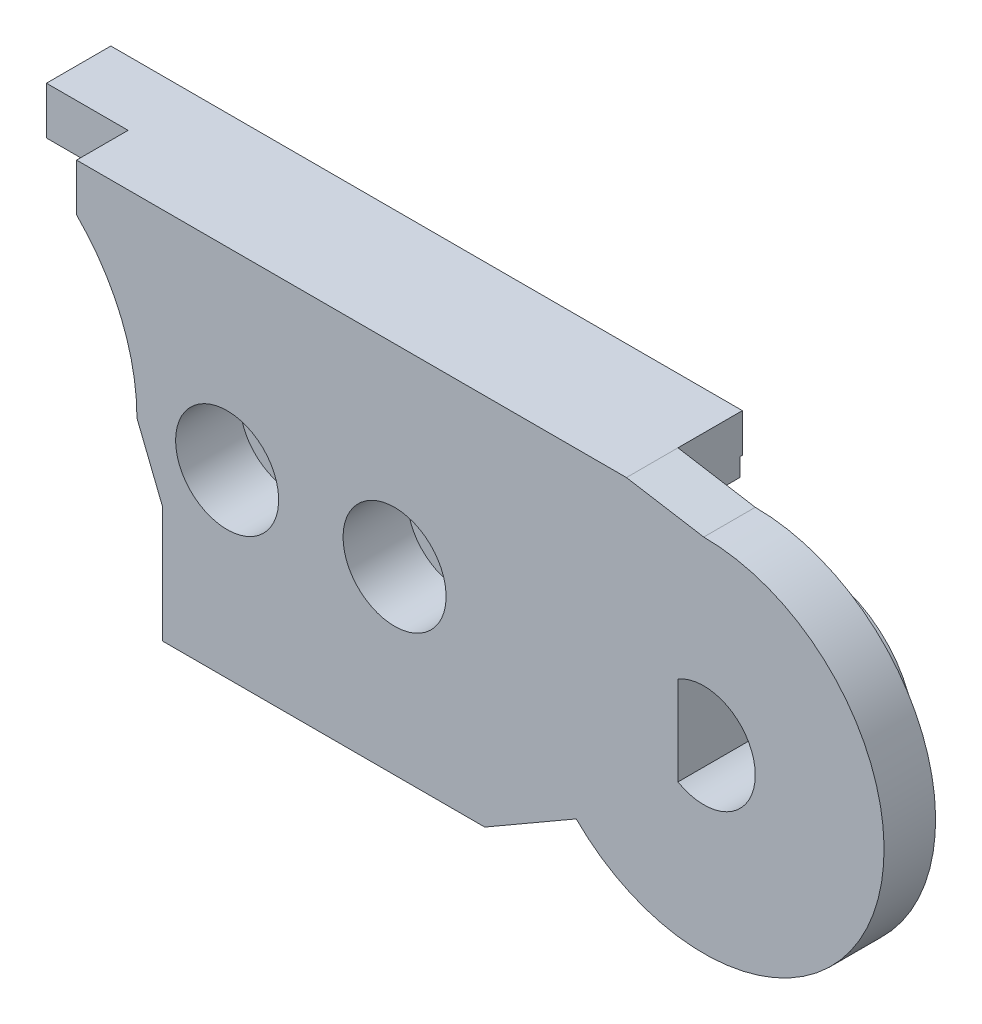
ISO-10303-21;
HEADER;
FILE_DESCRIPTION(('STEP AP214'),'2;1');
FILE_NAME('part.step','',(''),(''),'','','');
FILE_SCHEMA(('AUTOMOTIVE_DESIGN { 1 0 10303 214 1 1 1 1 }'));
ENDSEC;
DATA;
#1=APPLICATION_CONTEXT('core data for automotive mechanical design processes');
#2=APPLICATION_PROTOCOL_DEFINITION('international standard','automotive_design',2000,#1);
#3=PRODUCT_CONTEXT('',#1,'mechanical');
#4=PRODUCT('Part','Part','',(#3));
#5=PRODUCT_RELATED_PRODUCT_CATEGORY('part','',(#4));
#6=PRODUCT_DEFINITION_FORMATION('','',#4);
#7=PRODUCT_DEFINITION_CONTEXT('part definition',#1,'design');
#8=PRODUCT_DEFINITION('design','',#6,#7);
#9=PRODUCT_DEFINITION_SHAPE('','',#8);
#10=(LENGTH_UNIT() NAMED_UNIT(*) SI_UNIT(.MILLI.,.METRE.));
#11=(NAMED_UNIT(*) PLANE_ANGLE_UNIT() SI_UNIT($,.RADIAN.));
#12=(NAMED_UNIT(*) SI_UNIT($,.STERADIAN.) SOLID_ANGLE_UNIT());
#13=UNCERTAINTY_MEASURE_WITH_UNIT(LENGTH_MEASURE(1.E-05),#10,'distance_accuracy_value','');
#14=(GEOMETRIC_REPRESENTATION_CONTEXT(3) GLOBAL_UNCERTAINTY_ASSIGNED_CONTEXT((#13)) GLOBAL_UNIT_ASSIGNED_CONTEXT((#10,
#11,#12)) REPRESENTATION_CONTEXT('',''));
#15=CARTESIAN_POINT('',(0.,0.,0.));
#16=DIRECTION('',(0.,0.,1.));
#17=DIRECTION('',(1.,0.,0.));
#18=AXIS2_PLACEMENT_3D('',#15,#16,#17);
#19=CARTESIAN_POINT('',(18.,0.,16.));
#20=DIRECTION('',(0.,0.,-1.));
#21=DIRECTION('',(1.,0.,0.));
#22=AXIS2_PLACEMENT_3D('',#19,#20,#21);
#23=CYLINDRICAL_SURFACE('',#22,0.950000000000001);
#24=CARTESIAN_POINT('',(18.,0.,11.5));
#25=DIRECTION('',(0.,0.,1.));
#26=DIRECTION('',(1.,0.,0.));
#27=AXIS2_PLACEMENT_3D('',#24,#25,#26);
#28=CIRCLE('',#27,0.950000000000001);
#29=CARTESIAN_POINT('',(18.95,0.,11.5));
#30=VERTEX_POINT('',#29);
#31=EDGE_CURVE('E527',#30,#30,#28,.T.);
#32=ORIENTED_EDGE('',*,*,#31,.F.);
#33=EDGE_LOOP('',(#32));
#34=FACE_BOUND('',#33,.T.);
#35=CARTESIAN_POINT('',(18.,0.,13.5));
#36=DIRECTION('',(0.,0.,-1.));
#37=DIRECTION('',(-1.,0.,0.));
#38=AXIS2_PLACEMENT_3D('',#35,#36,#37);
#39=CIRCLE('',#38,0.950000000000001);
#40=CARTESIAN_POINT('',(17.05,0.,13.5));
#41=VERTEX_POINT('',#40);
#42=EDGE_CURVE('E46',#41,#41,#39,.F.);
#43=ORIENTED_EDGE('',*,*,#42,.T.);
#44=EDGE_LOOP('',(#43));
#45=FACE_BOUND('',#44,.T.);
#46=ADVANCED_FACE('F42',(#34,#45),#23,.F.);
#47=CARTESIAN_POINT('',(11.5,0.,16.));
#48=DIRECTION('',(0.,0.,-1.));
#49=DIRECTION('',(1.,0.,0.));
#50=AXIS2_PLACEMENT_3D('',#47,#48,#49);
#51=CYLINDRICAL_SURFACE('',#50,0.949999999999999);
#52=CARTESIAN_POINT('',(11.5,0.,11.5));
#53=DIRECTION('',(0.,0.,1.));
#54=DIRECTION('',(1.,0.,0.));
#55=AXIS2_PLACEMENT_3D('',#52,#53,#54);
#56=CIRCLE('',#55,0.949999999999999);
#57=CARTESIAN_POINT('',(12.45,0.,11.5));
#58=VERTEX_POINT('',#57);
#59=EDGE_CURVE('E241',#58,#58,#56,.T.);
#60=ORIENTED_EDGE('',*,*,#59,.F.);
#61=EDGE_LOOP('',(#60));
#62=FACE_BOUND('',#61,.T.);
#63=CARTESIAN_POINT('',(11.5,0.,13.5));
#64=DIRECTION('',(0.,0.,-1.));
#65=DIRECTION('',(-1.,0.,0.));
#66=AXIS2_PLACEMENT_3D('',#63,#64,#65);
#67=CIRCLE('',#66,0.949999999999999);
#68=CARTESIAN_POINT('',(10.55,0.,13.5));
#69=VERTEX_POINT('',#68);
#70=EDGE_CURVE('E518',#69,#69,#67,.F.);
#71=ORIENTED_EDGE('',*,*,#70,.T.);
#72=EDGE_LOOP('',(#71));
#73=FACE_BOUND('',#72,.T.);
#74=ADVANCED_FACE('F554',(#62,#73),#51,.F.);
#75=CARTESIAN_POINT('',(0.,0.,14.));
#76=DIRECTION('',(0.,0.,1.));
#77=DIRECTION('',(-1.,0.,0.));
#78=AXIS2_PLACEMENT_3D('',#75,#76,#77);
#79=CYLINDRICAL_SURFACE('',#78,8.);
#80=CARTESIAN_POINT('',(0.,0.,14.));
#81=DIRECTION('',(0.,0.,-1.));
#82=DIRECTION('',(-1.,0.,0.));
#83=AXIS2_PLACEMENT_3D('',#80,#81,#82);
#84=CIRCLE('',#83,8.);
#85=CARTESIAN_POINT('',(5.99249530663146,5.3,14.));
#86=VERTEX_POINT('',#85);
#87=CARTESIAN_POINT('',(6.92820323027551,4.,14.));
#88=VERTEX_POINT('',#87);
#89=EDGE_CURVE('E335',#86,#88,#84,.T.);
#90=ORIENTED_EDGE('',*,*,#89,.T.);
#91=DIRECTION('',(0.,0.,1.));
#92=VECTOR('',#91,1.);
#93=CARTESIAN_POINT('',(6.92820323027551,4.,14.));
#94=LINE('',#93,#92);
#95=CARTESIAN_POINT('',(6.92820323027551,4.,11.5));
#96=VERTEX_POINT('',#95);
#97=EDGE_CURVE('E327',#96,#88,#94,.T.);
#98=ORIENTED_EDGE('',*,*,#97,.F.);
#99=CARTESIAN_POINT('',(0.,0.,11.5));
#100=DIRECTION('',(0.,0.,-1.));
#101=DIRECTION('',(1.,0.,0.));
#102=AXIS2_PLACEMENT_3D('',#99,#100,#101);
#103=CIRCLE('',#102,8.);
#104=CARTESIAN_POINT('',(8.,0.,11.5));
#105=VERTEX_POINT('',#104);
#106=EDGE_CURVE('E345',#96,#105,#103,.T.);
#107=ORIENTED_EDGE('',*,*,#106,.T.);
#108=DIRECTION('',(0.,0.,1.));
#109=VECTOR('',#108,1.);
#110=CARTESIAN_POINT('',(8.,0.,14.));
#111=LINE('',#110,#109);
#112=CARTESIAN_POINT('',(8.,0.,16.));
#113=VERTEX_POINT('',#112);
#114=EDGE_CURVE('E496',#105,#113,#111,.T.);
#115=ORIENTED_EDGE('',*,*,#114,.T.);
#116=CARTESIAN_POINT('',(0.,0.,16.));
#117=DIRECTION('',(0.,0.,1.));
#118=DIRECTION('',(1.,0.,0.));
#119=AXIS2_PLACEMENT_3D('',#116,#117,#118);
#120=CIRCLE('',#119,8.);
#121=CARTESIAN_POINT('',(5.65685424949238,5.65685424949238,16.));
#122=VERTEX_POINT('',#121);
#123=EDGE_CURVE('E458',#113,#122,#120,.T.);
#124=ORIENTED_EDGE('',*,*,#123,.T.);
#125=DIRECTION('',(0.,0.,1.));
#126=VECTOR('',#125,1.);
#127=CARTESIAN_POINT('',(5.65685424949238,5.65685424949238,14.));
#128=LINE('',#127,#126);
#129=CARTESIAN_POINT('',(5.65685424949238,5.65685424949238,14.));
#130=VERTEX_POINT('',#129);
#131=EDGE_CURVE('E492',#130,#122,#128,.T.);
#132=ORIENTED_EDGE('',*,*,#131,.F.);
#133=DIRECTION('',(0.,0.,1.));
#134=VECTOR('',#133,1.);
#135=CARTESIAN_POINT('',(5.65685424949238,5.65685424949238,11.5));
#136=LINE('',#135,#134);
#137=CARTESIAN_POINT('',(5.65685424949238,5.65685424949238,11.5));
#138=VERTEX_POINT('',#137);
#139=EDGE_CURVE('E380',#138,#130,#136,.T.);
#140=ORIENTED_EDGE('',*,*,#139,.F.);
#141=CARTESIAN_POINT('',(5.99249530663145,5.3,11.5));
#142=VERTEX_POINT('',#141);
#143=EDGE_CURVE('E340',#138,#142,#103,.T.);
#144=ORIENTED_EDGE('',*,*,#143,.T.);
#145=DIRECTION('',(0.,0.,1.));
#146=VECTOR('',#145,1.);
#147=CARTESIAN_POINT('',(5.99249530663146,5.3,14.));
#148=LINE('',#147,#146);
#149=EDGE_CURVE('E331',#86,#142,#148,.F.);
#150=ORIENTED_EDGE('',*,*,#149,.F.);
#151=EDGE_LOOP('',(#90,#98,#107,#115,#124,#132,#140,#144,#150));
#152=FACE_BOUND('',#151,.T.);
#153=ADVANCED_FACE('F556',(#152),#79,.F.);
#154=CARTESIAN_POINT('',(27.,7.5,11.5));
#155=DIRECTION('',(-1.,0.,0.));
#156=DIRECTION('',(0.,0.,-1.));
#157=AXIS2_PLACEMENT_3D('',#154,#155,#156);
#158=PLANE('',#157);
#159=DIRECTION('',(0.,1.,0.));
#160=VECTOR('',#159,1.);
#161=CARTESIAN_POINT('',(27.,7.5,11.5));
#162=LINE('',#161,#160);
#163=CARTESIAN_POINT('',(27.,6.,11.5));
#164=VERTEX_POINT('',#163);
#165=CARTESIAN_POINT('',(27.,7.5,11.5));
#166=VERTEX_POINT('',#165);
#167=EDGE_CURVE('E365',#164,#166,#162,.T.);
#168=ORIENTED_EDGE('',*,*,#167,.T.);
#169=DIRECTION('',(0.,0.,1.));
#170=VECTOR('',#169,1.);
#171=CARTESIAN_POINT('',(27.,7.5,11.5));
#172=LINE('',#171,#170);
#173=CARTESIAN_POINT('',(27.,7.5,14.));
#174=VERTEX_POINT('',#173);
#175=EDGE_CURVE('E414',#166,#174,#172,.T.);
#176=ORIENTED_EDGE('',*,*,#175,.T.);
#177=DIRECTION('',(0.,1.,0.));
#178=VECTOR('',#177,1.);
#179=CARTESIAN_POINT('',(27.,7.5,14.));
#180=LINE('',#179,#178);
#181=CARTESIAN_POINT('',(27.,5.3,14.));
#182=VERTEX_POINT('',#181);
#183=EDGE_CURVE('E388',#182,#174,#180,.T.);
#184=ORIENTED_EDGE('',*,*,#183,.F.);
#185=DIRECTION('',(0.,0.,1.));
#186=VECTOR('',#185,1.);
#187=CARTESIAN_POINT('',(27.,5.3,11.5));
#188=LINE('',#187,#186);
#189=CARTESIAN_POINT('',(27.,5.3,11.6));
#190=VERTEX_POINT('',#189);
#191=EDGE_CURVE('E317',#190,#182,#188,.T.);
#192=ORIENTED_EDGE('',*,*,#191,.F.);
#193=DIRECTION('',(0.,1.,0.));
#194=VECTOR('',#193,1.);
#195=CARTESIAN_POINT('',(27.,2.1720062451962,11.6));
#196=LINE('',#195,#194);
#197=CARTESIAN_POINT('',(27.,6.,11.6));
#198=VERTEX_POINT('',#197);
#199=EDGE_CURVE('E273',#190,#198,#196,.T.);
#200=ORIENTED_EDGE('',*,*,#199,.T.);
#201=DIRECTION('',(0.,0.,-1.));
#202=VECTOR('',#201,1.);
#203=CARTESIAN_POINT('',(27.,6.,11.6));
#204=LINE('',#203,#202);
#205=EDGE_CURVE('E284',#198,#164,#204,.T.);
#206=ORIENTED_EDGE('',*,*,#205,.T.);
#207=EDGE_LOOP('',(#168,#176,#184,#192,#200,#206));
#208=FACE_BOUND('',#207,.T.);
#209=ADVANCED_FACE('F562',(#208),#158,.F.);
#210=CARTESIAN_POINT('',(0.,0.,11.5));
#211=DIRECTION('',(0.,0.,-1.));
#212=DIRECTION('',(1.,0.,0.));
#213=AXIS2_PLACEMENT_3D('',#210,#211,#212);
#214=PLANE('',#213);
#215=DIRECTION('',(0.,-1.,0.));
#216=VECTOR('',#215,1.);
#217=CARTESIAN_POINT('',(21.5203540034992,0.,11.5));
#218=LINE('',#217,#216);
#219=CARTESIAN_POINT('',(21.5203540034992,6.,11.5));
#220=VERTEX_POINT('',#219);
#221=CARTESIAN_POINT('',(21.5203540034992,5.3,11.5));
#222=VERTEX_POINT('',#221);
#223=EDGE_CURVE('E305',#220,#222,#218,.T.);
#224=ORIENTED_EDGE('',*,*,#223,.T.);
#225=DIRECTION('',(-1.,0.,0.));
#226=VECTOR('',#225,1.);
#227=CARTESIAN_POINT('',(18.0980804477077,5.3,11.5));
#228=LINE('',#227,#226);
#229=EDGE_CURVE('E314',#222,#142,#228,.T.);
#230=ORIENTED_EDGE('',*,*,#229,.T.);
#231=ORIENTED_EDGE('',*,*,#143,.F.);
#232=DIRECTION('',(1.,0.,0.));
#233=VECTOR('',#232,1.);
#234=CARTESIAN_POINT('',(5.65685424949238,5.65685424949238,11.5));
#235=LINE('',#234,#233);
#236=CARTESIAN_POINT('',(2.48679014755027,5.65685424949238,11.5));
#237=VERTEX_POINT('',#236);
#238=EDGE_CURVE('E377',#237,#138,#235,.T.);
#239=ORIENTED_EDGE('',*,*,#238,.F.);
#240=DIRECTION('',(0.,-1.,0.));
#241=VECTOR('',#240,1.);
#242=CARTESIAN_POINT('',(2.48679014755027,7.5,11.5));
#243=LINE('',#242,#241);
#244=CARTESIAN_POINT('',(2.48679014755027,7.5,11.5));
#245=VERTEX_POINT('',#244);
#246=EDGE_CURVE('E373',#245,#237,#243,.T.);
#247=ORIENTED_EDGE('',*,*,#246,.F.);
#248=DIRECTION('',(-1.,0.,0.));
#249=VECTOR('',#248,1.);
#250=CARTESIAN_POINT('',(21.5,7.5,11.5));
#251=LINE('',#250,#249);
#252=EDGE_CURVE('E369',#166,#245,#251,.T.);
#253=ORIENTED_EDGE('',*,*,#252,.F.);
#254=ORIENTED_EDGE('',*,*,#167,.F.);
#255=DIRECTION('',(-1.,0.,0.));
#256=VECTOR('',#255,1.);
#257=CARTESIAN_POINT('',(0.,6.,11.5));
#258=LINE('',#257,#256);
#259=EDGE_CURVE('E12',#164,#220,#258,.T.);
#260=ORIENTED_EDGE('',*,*,#259,.T.);
#261=EDGE_LOOP('',(#224,#230,#231,#239,#247,#253,#254,#260));
#262=FACE_BOUND('',#261,.T.);
#263=ADVANCED_FACE('F615',(#262),#214,.T.);
#264=ORIENTED_EDGE('',*,*,#59,.T.);
#265=EDGE_LOOP('',(#264));
#266=FACE_BOUND('',#265,.T.);
#267=ORIENTED_EDGE('',*,*,#31,.T.);
#268=EDGE_LOOP('',(#267));
#269=FACE_BOUND('',#268,.T.);
#270=DIRECTION('',(1.,0.,0.));
#271=VECTOR('',#270,1.);
#272=CARTESIAN_POINT('',(0.,2.1720062451962,11.5));
#273=LINE('',#272,#271);
#274=CARTESIAN_POINT('',(21.5203540034992,2.1720062451962,11.5));
#275=VERTEX_POINT('',#274);
#276=CARTESIAN_POINT('',(23.2751262658471,2.1720062451962,11.5));
#277=VERTEX_POINT('',#276);
#278=EDGE_CURVE('E309',#275,#277,#273,.T.);
#279=ORIENTED_EDGE('',*,*,#278,.T.);
#280=DIRECTION('',(0.,1.,0.));
#281=VECTOR('',#280,1.);
#282=CARTESIAN_POINT('',(23.2751262658471,-5.97487373415292,11.5));
#283=LINE('',#282,#281);
#284=CARTESIAN_POINT('',(23.2751262658471,-5.97487373415292,11.5));
#285=VERTEX_POINT('',#284);
#286=EDGE_CURVE('E361',#285,#277,#283,.T.);
#287=ORIENTED_EDGE('',*,*,#286,.F.);
#288=DIRECTION('',(0.865971186561437,0.500093895229063,0.));
#289=VECTOR('',#288,1.);
#290=CARTESIAN_POINT('',(21.5,-6.99999999999999,11.5));
#291=LINE('',#290,#289);
#292=CARTESIAN_POINT('',(21.5,-6.99999999999999,11.5));
#293=VERTEX_POINT('',#292);
#294=EDGE_CURVE('E357',#293,#285,#291,.T.);
#295=ORIENTED_EDGE('',*,*,#294,.F.);
#296=DIRECTION('',(1.,0.,0.));
#297=VECTOR('',#296,1.);
#298=CARTESIAN_POINT('',(9.,-6.99999999999999,11.5));
#299=LINE('',#298,#297);
#300=CARTESIAN_POINT('',(9.,-6.99999999999999,11.5));
#301=VERTEX_POINT('',#300);
#302=EDGE_CURVE('E353',#301,#293,#299,.T.);
#303=ORIENTED_EDGE('',*,*,#302,.F.);
#304=DIRECTION('',(0.,-1.,0.));
#305=VECTOR('',#304,1.);
#306=CARTESIAN_POINT('',(9.,-2.5,11.5));
#307=LINE('',#306,#305);
#308=CARTESIAN_POINT('',(9.,-2.5,11.5));
#309=VERTEX_POINT('',#308);
#310=EDGE_CURVE('E349',#309,#301,#307,.T.);
#311=ORIENTED_EDGE('',*,*,#310,.F.);
#312=DIRECTION('',(0.371390676354105,-0.928476690885259,0.));
#313=VECTOR('',#312,1.);
#314=CARTESIAN_POINT('',(8.,0.,11.5));
#315=LINE('',#314,#313);
#316=EDGE_CURVE('E344',#105,#309,#315,.T.);
#317=ORIENTED_EDGE('',*,*,#316,.F.);
#318=ORIENTED_EDGE('',*,*,#106,.F.);
#319=DIRECTION('',(-1.,0.,0.));
#320=VECTOR('',#319,1.);
#321=CARTESIAN_POINT('',(0.,4.,11.5));
#322=LINE('',#321,#320);
#323=CARTESIAN_POINT('',(21.5203540034992,4.,11.5));
#324=VERTEX_POINT('',#323);
#325=EDGE_CURVE('E479',#324,#96,#322,.T.);
#326=ORIENTED_EDGE('',*,*,#325,.F.);
#327=DIRECTION('',(0.,-1.,0.));
#328=VECTOR('',#327,1.);
#329=CARTESIAN_POINT('',(21.5203540034992,0.,11.5));
#330=LINE('',#329,#328);
#331=EDGE_CURVE('E297',#324,#275,#330,.T.);
#332=ORIENTED_EDGE('',*,*,#331,.T.);
#333=EDGE_LOOP('',(#279,#287,#295,#303,#311,#317,#318,#326,#332));
#334=FACE_BOUND('',#333,.T.);
#335=ADVANCED_FACE('F551',(#266,#269,#334),#214,.T.);
#336=CARTESIAN_POINT('',(25.0502525316942,-4.94974746830585,14.));
#337=DIRECTION('',(0.500093895229062,-0.865971186561437,0.));
#338=DIRECTION('',(0.865971186561437,0.500093895229062,0.));
#339=AXIS2_PLACEMENT_3D('',#336,#337,#338);
#340=PLANE('',#339);
#341=DIRECTION('',(-0.865971186561437,-0.500093895229062,0.));
#342=VECTOR('',#341,1.);
#343=CARTESIAN_POINT('',(25.0502525316942,-4.94974746830585,16.));
#344=LINE('',#343,#342);
#345=CARTESIAN_POINT('',(25.0502525316942,-4.94974746830584,16.));
#346=VERTEX_POINT('',#345);
#347=CARTESIAN_POINT('',(21.5,-6.99999999999999,16.));
#348=VERTEX_POINT('',#347);
#349=EDGE_CURVE('E427',#346,#348,#344,.T.);
#350=ORIENTED_EDGE('',*,*,#349,.T.);
#351=DIRECTION('',(0.,0.,1.));
#352=VECTOR('',#351,1.);
#353=CARTESIAN_POINT('',(21.5,-6.99999999999999,14.));
#354=LINE('',#353,#352);
#355=EDGE_CURVE('E444',#293,#348,#354,.T.);
#356=ORIENTED_EDGE('',*,*,#355,.F.);
#357=ORIENTED_EDGE('',*,*,#294,.T.);
#358=DIRECTION('',(0.,0.,1.));
#359=VECTOR('',#358,1.);
#360=CARTESIAN_POINT('',(23.2751262658471,-5.97487373415292,11.5));
#361=LINE('',#360,#359);
#362=CARTESIAN_POINT('',(23.2751262658471,-5.97487373415292,14.));
#363=VERTEX_POINT('',#362);
#364=EDGE_CURVE('E423',#285,#363,#361,.T.);
#365=ORIENTED_EDGE('',*,*,#364,.T.);
#366=DIRECTION('',(-0.865971186561437,-0.500093895229062,0.));
#367=VECTOR('',#366,1.);
#368=CARTESIAN_POINT('',(25.0502525316942,-4.94974746830585,14.));
#369=LINE('',#368,#367);
#370=CARTESIAN_POINT('',(25.0502525316942,-4.94974746830584,14.));
#371=VERTEX_POINT('',#370);
#372=EDGE_CURVE('E428',#371,#363,#369,.T.);
#373=ORIENTED_EDGE('',*,*,#372,.F.);
#374=DIRECTION('',(0.,0.,1.));
#375=VECTOR('',#374,1.);
#376=CARTESIAN_POINT('',(25.0502525316942,-4.94974746830584,14.));
#377=LINE('',#376,#375);
#378=EDGE_CURVE('E475',#371,#346,#377,.T.);
#379=ORIENTED_EDGE('',*,*,#378,.T.);
#380=EDGE_LOOP('',(#350,#356,#357,#365,#373,#379));
#381=FACE_BOUND('',#380,.T.);
#382=ADVANCED_FACE('F44',(#381),#340,.T.);
#383=CARTESIAN_POINT('',(30.,0.,14.));
#384=DIRECTION('',(0.,0.,1.));
#385=DIRECTION('',(-1.,0.,0.));
#386=AXIS2_PLACEMENT_3D('',#383,#384,#385);
#387=CYLINDRICAL_SURFACE('',#386,7.);
#388=CARTESIAN_POINT('',(30.,0.,16.));
#389=DIRECTION('',(0.,0.,1.));
#390=DIRECTION('',(1.,0.,0.));
#391=AXIS2_PLACEMENT_3D('',#388,#389,#390);
#392=CIRCLE('',#391,7.);
#393=CARTESIAN_POINT('',(30.,7.00000000000001,16.));
#394=VERTEX_POINT('',#393);
#395=EDGE_CURVE('E433',#346,#394,#392,.T.);
#396=ORIENTED_EDGE('',*,*,#395,.F.);
#397=ORIENTED_EDGE('',*,*,#378,.F.);
#398=CARTESIAN_POINT('',(30.,0.,14.));
#399=DIRECTION('',(0.,0.,1.));
#400=DIRECTION('',(1.,0.,0.));
#401=AXIS2_PLACEMENT_3D('',#398,#399,#400);
#402=CIRCLE('',#401,7.);
#403=CARTESIAN_POINT('',(30.,7.00000000000001,14.));
#404=VERTEX_POINT('',#403);
#405=EDGE_CURVE('E440',#371,#404,#402,.T.);
#406=ORIENTED_EDGE('',*,*,#405,.T.);
#407=DIRECTION('',(0.,0.,1.));
#408=VECTOR('',#407,1.);
#409=CARTESIAN_POINT('',(30.,7.00000000000001,14.));
#410=LINE('',#409,#408);
#411=EDGE_CURVE('E480',#404,#394,#410,.T.);
#412=ORIENTED_EDGE('',*,*,#411,.T.);
#413=EDGE_LOOP('',(#396,#397,#406,#412));
#414=FACE_BOUND('',#413,.T.);
#415=ADVANCED_FACE('F649',(#414),#387,.T.);
#416=CARTESIAN_POINT('',(30.,7.00000000000001,14.));
#417=DIRECTION('',(-0.164398987305353,-0.986393923832144,0.));
#418=DIRECTION('',(0.986393923832144,-0.164398987305353,0.));
#419=AXIS2_PLACEMENT_3D('',#416,#417,#418);
#420=PLANE('',#419);
#421=DIRECTION('',(-0.986393923832145,0.164398987305353,0.));
#422=VECTOR('',#421,1.);
#423=CARTESIAN_POINT('',(30.,7.00000000000001,16.));
#424=LINE('',#423,#422);
#425=CARTESIAN_POINT('',(27.,7.5,16.));
#426=VERTEX_POINT('',#425);
#427=EDGE_CURVE('E468',#394,#426,#424,.T.);
#428=ORIENTED_EDGE('',*,*,#427,.F.);
#429=ORIENTED_EDGE('',*,*,#411,.F.);
#430=DIRECTION('',(-0.986393923832145,0.164398987305353,0.));
#431=VECTOR('',#430,1.);
#432=CARTESIAN_POINT('',(30.,7.00000000000001,14.));
#433=LINE('',#432,#431);
#434=EDGE_CURVE('E436',#404,#174,#433,.T.);
#435=ORIENTED_EDGE('',*,*,#434,.T.);
#436=DIRECTION('',(0.,0.,1.));
#437=VECTOR('',#436,1.);
#438=CARTESIAN_POINT('',(27.,7.5,14.));
#439=LINE('',#438,#437);
#440=EDGE_CURVE('E484',#174,#426,#439,.T.);
#441=ORIENTED_EDGE('',*,*,#440,.T.);
#442=EDGE_LOOP('',(#428,#429,#435,#441));
#443=FACE_BOUND('',#442,.T.);
#444=ADVANCED_FACE('F652',(#443),#420,.F.);
#445=CARTESIAN_POINT('',(5.65685424949238,7.5,14.));
#446=DIRECTION('',(0.,1.,0.));
#447=DIRECTION('',(-1.,0.,0.));
#448=AXIS2_PLACEMENT_3D('',#445,#446,#447);
#449=PLANE('',#448);
#450=DIRECTION('',(1.,0.,0.));
#451=VECTOR('',#450,1.);
#452=CARTESIAN_POINT('',(5.65685424949238,7.5,16.));
#453=LINE('',#452,#451);
#454=CARTESIAN_POINT('',(5.65685424949238,7.5,16.));
#455=VERTEX_POINT('',#454);
#456=EDGE_CURVE('E465',#455,#426,#453,.T.);
#457=ORIENTED_EDGE('',*,*,#456,.T.);
#458=ORIENTED_EDGE('',*,*,#440,.F.);
#459=ORIENTED_EDGE('',*,*,#175,.F.);
#460=ORIENTED_EDGE('',*,*,#252,.T.);
#461=DIRECTION('',(0.,0.,1.));
#462=VECTOR('',#461,1.);
#463=CARTESIAN_POINT('',(2.48679014755027,7.5,11.5));
#464=LINE('',#463,#462);
#465=CARTESIAN_POINT('',(2.48679014755027,7.5,14.));
#466=VERTEX_POINT('',#465);
#467=EDGE_CURVE('E410',#245,#466,#464,.T.);
#468=ORIENTED_EDGE('',*,*,#467,.T.);
#469=DIRECTION('',(-1.,0.,0.));
#470=VECTOR('',#469,1.);
#471=CARTESIAN_POINT('',(5.65685424949238,7.5,14.));
#472=LINE('',#471,#470);
#473=CARTESIAN_POINT('',(5.65685424949238,7.5,14.));
#474=VERTEX_POINT('',#473);
#475=EDGE_CURVE('E392',#474,#466,#472,.T.);
#476=ORIENTED_EDGE('',*,*,#475,.F.);
#477=DIRECTION('',(0.,0.,1.));
#478=VECTOR('',#477,1.);
#479=CARTESIAN_POINT('',(5.65685424949238,7.5,14.));
#480=LINE('',#479,#478);
#481=EDGE_CURVE('E488',#474,#455,#480,.T.);
#482=ORIENTED_EDGE('',*,*,#481,.T.);
#483=EDGE_LOOP('',(#457,#458,#459,#460,#468,#476,#482));
#484=FACE_BOUND('',#483,.T.);
#485=ADVANCED_FACE('F656',(#484),#449,.T.);
#486=CARTESIAN_POINT('',(5.65685424949238,5.65685424949238,14.));
#487=DIRECTION('',(-1.,0.,0.));
#488=DIRECTION('',(0.,0.,-1.));
#489=AXIS2_PLACEMENT_3D('',#486,#487,#488);
#490=PLANE('',#489);
#491=DIRECTION('',(0.,1.,0.));
#492=VECTOR('',#491,1.);
#493=CARTESIAN_POINT('',(5.65685424949238,5.65685424949238,16.));
#494=LINE('',#493,#492);
#495=EDGE_CURVE('E462',#122,#455,#494,.T.);
#496=ORIENTED_EDGE('',*,*,#495,.T.);
#497=ORIENTED_EDGE('',*,*,#481,.F.);
#498=DIRECTION('',(0.,1.,0.));
#499=VECTOR('',#498,1.);
#500=CARTESIAN_POINT('',(5.65685424949238,5.65685424949238,14.));
#501=LINE('',#500,#499);
#502=EDGE_CURVE('E432',#130,#474,#501,.T.);
#503=ORIENTED_EDGE('',*,*,#502,.F.);
#504=ORIENTED_EDGE('',*,*,#131,.T.);
#505=EDGE_LOOP('',(#496,#497,#503,#504));
#506=FACE_BOUND('',#505,.T.);
#507=ADVANCED_FACE('F660',(#506),#490,.T.);
#508=CARTESIAN_POINT('',(8.,0.,14.));
#509=DIRECTION('',(0.928476690885259,0.371390676354104,0.));
#510=DIRECTION('',(-0.371390676354104,0.928476690885259,0.));
#511=AXIS2_PLACEMENT_3D('',#508,#509,#510);
#512=PLANE('',#511);
#513=DIRECTION('',(0.371390676354104,-0.928476690885259,0.));
#514=VECTOR('',#513,1.);
#515=CARTESIAN_POINT('',(8.,0.,16.));
#516=LINE('',#515,#514);
#517=CARTESIAN_POINT('',(9.,-2.5,16.));
#518=VERTEX_POINT('',#517);
#519=EDGE_CURVE('E454',#113,#518,#516,.T.);
#520=ORIENTED_EDGE('',*,*,#519,.F.);
#521=ORIENTED_EDGE('',*,*,#114,.F.);
#522=ORIENTED_EDGE('',*,*,#316,.T.);
#523=DIRECTION('',(0.,0.,1.));
#524=VECTOR('',#523,1.);
#525=CARTESIAN_POINT('',(9.,-2.5,14.));
#526=LINE('',#525,#524);
#527=EDGE_CURVE('E500',#309,#518,#526,.T.);
#528=ORIENTED_EDGE('',*,*,#527,.T.);
#529=EDGE_LOOP('',(#520,#521,#522,#528));
#530=FACE_BOUND('',#529,.T.);
#531=ADVANCED_FACE('F663',(#530),#512,.F.);
#532=CARTESIAN_POINT('',(9.,-6.99999999999999,14.));
#533=DIRECTION('',(-1.,0.,0.));
#534=DIRECTION('',(0.,0.,-1.));
#535=AXIS2_PLACEMENT_3D('',#532,#533,#534);
#536=PLANE('',#535);
#537=DIRECTION('',(0.,1.,0.));
#538=VECTOR('',#537,1.);
#539=CARTESIAN_POINT('',(9.,-6.99999999999999,16.));
#540=LINE('',#539,#538);
#541=CARTESIAN_POINT('',(9.,-6.99999999999999,16.));
#542=VERTEX_POINT('',#541);
#543=EDGE_CURVE('E451',#542,#518,#540,.T.);
#544=ORIENTED_EDGE('',*,*,#543,.T.);
#545=ORIENTED_EDGE('',*,*,#527,.F.);
#546=ORIENTED_EDGE('',*,*,#310,.T.);
#547=DIRECTION('',(0.,0.,1.));
#548=VECTOR('',#547,1.);
#549=CARTESIAN_POINT('',(9.,-6.99999999999999,14.));
#550=LINE('',#549,#548);
#551=EDGE_CURVE('E504',#301,#542,#550,.T.);
#552=ORIENTED_EDGE('',*,*,#551,.T.);
#553=EDGE_LOOP('',(#544,#545,#546,#552));
#554=FACE_BOUND('',#553,.T.);
#555=ADVANCED_FACE('F668',(#554),#536,.T.);
#556=CARTESIAN_POINT('',(21.5,-6.99999999999999,14.));
#557=DIRECTION('',(0.,-1.,0.));
#558=DIRECTION('',(1.,0.,0.));
#559=AXIS2_PLACEMENT_3D('',#556,#557,#558);
#560=PLANE('',#559);
#561=DIRECTION('',(-1.,0.,0.));
#562=VECTOR('',#561,1.);
#563=CARTESIAN_POINT('',(21.5,-6.99999999999999,16.));
#564=LINE('',#563,#562);
#565=EDGE_CURVE('E448',#348,#542,#564,.T.);
#566=ORIENTED_EDGE('',*,*,#565,.T.);
#567=ORIENTED_EDGE('',*,*,#551,.F.);
#568=ORIENTED_EDGE('',*,*,#302,.T.);
#569=ORIENTED_EDGE('',*,*,#355,.T.);
#570=EDGE_LOOP('',(#566,#567,#568,#569));
#571=FACE_BOUND('',#570,.T.);
#572=ADVANCED_FACE('F644',(#571),#560,.T.);
#573=CARTESIAN_POINT('',(0.,0.,14.));
#574=DIRECTION('',(0.,0.,-1.));
#575=DIRECTION('',(1.,0.,0.));
#576=AXIS2_PLACEMENT_3D('',#573,#574,#575);
#577=PLANE('',#576);
#578=CARTESIAN_POINT('',(30.,0.,14.));
#579=DIRECTION('',(0.,0.,1.));
#580=DIRECTION('',(1.,0.,0.));
#581=AXIS2_PLACEMENT_3D('',#578,#579,#580);
#582=CIRCLE('',#581,3.89999999999999);
#583=CARTESIAN_POINT('',(33.9,0.,14.));
#584=VERTEX_POINT('',#583);
#585=EDGE_CURVE('E245',#584,#584,#582,.T.);
#586=ORIENTED_EDGE('',*,*,#585,.T.);
#587=EDGE_LOOP('',(#586));
#588=FACE_BOUND('',#587,.T.);
#589=DIRECTION('',(0.,-1.,0.));
#590=VECTOR('',#589,1.);
#591=CARTESIAN_POINT('',(23.3,2.1720062451962,14.));
#592=LINE('',#591,#590);
#593=CARTESIAN_POINT('',(23.3,4.,14.));
#594=VERTEX_POINT('',#593);
#595=CARTESIAN_POINT('',(23.3,2.1720062451962,14.));
#596=VERTEX_POINT('',#595);
#597=EDGE_CURVE('E255',#594,#596,#592,.T.);
#598=ORIENTED_EDGE('',*,*,#597,.F.);
#599=DIRECTION('',(1.,0.,0.));
#600=VECTOR('',#599,1.);
#601=CARTESIAN_POINT('',(27.,4.,14.));
#602=LINE('',#601,#600);
#603=EDGE_CURVE('E318',#88,#594,#602,.T.);
#604=ORIENTED_EDGE('',*,*,#603,.F.);
#605=ORIENTED_EDGE('',*,*,#89,.F.);
#606=DIRECTION('',(-1.,0.,0.));
#607=VECTOR('',#606,1.);
#608=CARTESIAN_POINT('',(18.0980804477077,5.3,14.));
#609=LINE('',#608,#607);
#610=EDGE_CURVE('E313',#182,#86,#609,.T.);
#611=ORIENTED_EDGE('',*,*,#610,.F.);
#612=ORIENTED_EDGE('',*,*,#183,.T.);
#613=ORIENTED_EDGE('',*,*,#434,.F.);
#614=ORIENTED_EDGE('',*,*,#405,.F.);
#615=ORIENTED_EDGE('',*,*,#372,.T.);
#616=DIRECTION('',(0.,1.,0.));
#617=VECTOR('',#616,1.);
#618=CARTESIAN_POINT('',(23.2751262658471,-5.97487373415292,14.));
#619=LINE('',#618,#617);
#620=CARTESIAN_POINT('',(23.2751262658471,2.1720062451962,14.));
#621=VERTEX_POINT('',#620);
#622=EDGE_CURVE('E339',#363,#621,#619,.T.);
#623=ORIENTED_EDGE('',*,*,#622,.T.);
#624=DIRECTION('',(1.,0.,0.));
#625=VECTOR('',#624,1.);
#626=CARTESIAN_POINT('',(27.,2.1720062451962,14.));
#627=LINE('',#626,#625);
#628=EDGE_CURVE('E384',#621,#596,#627,.T.);
#629=ORIENTED_EDGE('',*,*,#628,.T.);
#630=EDGE_LOOP('',(#598,#604,#605,#611,#612,#613,#614,#615,#623,#629));
#631=FACE_BOUND('',#630,.T.);
#632=ADVANCED_FACE('F641',(#588,#631),#577,.T.);
#633=CARTESIAN_POINT('',(0.,0.,16.));
#634=DIRECTION('',(0.,0.,-1.));
#635=DIRECTION('',(1.,0.,0.));
#636=AXIS2_PLACEMENT_3D('',#633,#634,#635);
#637=PLANE('',#636);
#638=CARTESIAN_POINT('',(11.5,0.,16.));
#639=DIRECTION('',(0.,0.,-1.));
#640=DIRECTION('',(-1.,0.,0.));
#641=AXIS2_PLACEMENT_3D('',#638,#639,#640);
#642=CIRCLE('',#641,2.);
#643=CARTESIAN_POINT('',(9.5,0.,16.));
#644=VERTEX_POINT('',#643);
#645=EDGE_CURVE('E529',#644,#644,#642,.T.);
#646=ORIENTED_EDGE('',*,*,#645,.T.);
#647=EDGE_LOOP('',(#646));
#648=FACE_BOUND('',#647,.T.);
#649=CARTESIAN_POINT('',(18.,0.,16.));
#650=DIRECTION('',(0.,0.,-1.));
#651=DIRECTION('',(-1.,0.,0.));
#652=AXIS2_PLACEMENT_3D('',#649,#650,#651);
#653=CIRCLE('',#652,2.);
#654=CARTESIAN_POINT('',(16.,0.,16.));
#655=VERTEX_POINT('',#654);
#656=EDGE_CURVE('E541',#655,#655,#653,.T.);
#657=ORIENTED_EDGE('',*,*,#656,.T.);
#658=EDGE_LOOP('',(#657));
#659=FACE_BOUND('',#658,.T.);
#660=DIRECTION('',(0.,-1.,0.));
#661=VECTOR('',#660,1.);
#662=CARTESIAN_POINT('',(29.,1.73205080756886,16.));
#663=LINE('',#662,#661);
#664=CARTESIAN_POINT('',(29.,1.73205080756886,16.));
#665=VERTEX_POINT('',#664);
#666=CARTESIAN_POINT('',(29.,-1.73205080756886,16.));
#667=VERTEX_POINT('',#666);
#668=EDGE_CURVE('E221',#665,#667,#663,.T.);
#669=ORIENTED_EDGE('',*,*,#668,.F.);
#670=CARTESIAN_POINT('',(30.,0.,16.));
#671=DIRECTION('',(0.,0.,1.));
#672=DIRECTION('',(1.,0.,0.));
#673=AXIS2_PLACEMENT_3D('',#670,#671,#672);
#674=CIRCLE('',#673,1.99999999999999);
#675=EDGE_CURVE('E227',#667,#665,#674,.T.);
#676=ORIENTED_EDGE('',*,*,#675,.F.);
#677=EDGE_LOOP('',(#669,#676));
#678=FACE_BOUND('',#677,.T.);
#679=ORIENTED_EDGE('',*,*,#349,.F.);
#680=ORIENTED_EDGE('',*,*,#395,.T.);
#681=ORIENTED_EDGE('',*,*,#427,.T.);
#682=ORIENTED_EDGE('',*,*,#456,.F.);
#683=ORIENTED_EDGE('',*,*,#495,.F.);
#684=ORIENTED_EDGE('',*,*,#123,.F.);
#685=ORIENTED_EDGE('',*,*,#519,.T.);
#686=ORIENTED_EDGE('',*,*,#543,.F.);
#687=ORIENTED_EDGE('',*,*,#565,.F.);
#688=EDGE_LOOP('',(#679,#680,#681,#682,#683,#684,#685,#686,#687));
#689=FACE_BOUND('',#688,.T.);
#690=ADVANCED_FACE('F232',(#648,#659,#678,#689),#637,.F.);
#691=CARTESIAN_POINT('',(23.2751262658471,-5.97487373415292,11.5));
#692=DIRECTION('',(-1.,0.,0.));
#693=DIRECTION('',(0.,0.,-1.));
#694=AXIS2_PLACEMENT_3D('',#691,#692,#693);
#695=PLANE('',#694);
#696=ORIENTED_EDGE('',*,*,#622,.F.);
#697=ORIENTED_EDGE('',*,*,#364,.F.);
#698=ORIENTED_EDGE('',*,*,#286,.T.);
#699=DIRECTION('',(0.,0.,1.));
#700=VECTOR('',#699,1.);
#701=CARTESIAN_POINT('',(23.2751262658471,2.1720062451962,11.5));
#702=LINE('',#701,#700);
#703=CARTESIAN_POINT('',(23.2751262658471,2.1720062451962,11.6));
#704=VERTEX_POINT('',#703);
#705=EDGE_CURVE('E419',#277,#704,#702,.T.);
#706=ORIENTED_EDGE('',*,*,#705,.T.);
#707=EDGE_CURVE('E418',#704,#621,#702,.T.);
#708=ORIENTED_EDGE('',*,*,#707,.T.);
#709=EDGE_LOOP('',(#696,#697,#698,#706,#708));
#710=FACE_BOUND('',#709,.T.);
#711=ADVANCED_FACE('F636',(#710),#695,.F.);
#712=CARTESIAN_POINT('',(27.,2.1720062451962,11.5));
#713=DIRECTION('',(0.,1.,0.));
#714=DIRECTION('',(0.,0.,-1.));
#715=AXIS2_PLACEMENT_3D('',#712,#713,#714);
#716=PLANE('',#715);
#717=ORIENTED_EDGE('',*,*,#628,.F.);
#718=ORIENTED_EDGE('',*,*,#707,.F.);
#719=DIRECTION('',(1.,0.,0.));
#720=VECTOR('',#719,1.);
#721=CARTESIAN_POINT('',(27.,2.1720062451962,11.6));
#722=LINE('',#721,#720);
#723=CARTESIAN_POINT('',(23.3,2.1720062451962,11.6));
#724=VERTEX_POINT('',#723);
#725=EDGE_CURVE('E266',#704,#724,#722,.T.);
#726=ORIENTED_EDGE('',*,*,#725,.T.);
#727=DIRECTION('',(0.,0.,-1.));
#728=VECTOR('',#727,1.);
#729=CARTESIAN_POINT('',(23.3,2.1720062451962,14.));
#730=LINE('',#729,#728);
#731=EDGE_CURVE('E262',#596,#724,#730,.T.);
#732=ORIENTED_EDGE('',*,*,#731,.F.);
#733=EDGE_LOOP('',(#717,#718,#726,#732));
#734=FACE_BOUND('',#733,.T.);
#735=ADVANCED_FACE('F629',(#734),#716,.F.);
#736=CARTESIAN_POINT('',(2.48679014755027,7.5,11.5));
#737=DIRECTION('',(1.,0.,0.));
#738=DIRECTION('',(0.,0.,1.));
#739=AXIS2_PLACEMENT_3D('',#736,#737,#738);
#740=PLANE('',#739);
#741=DIRECTION('',(0.,-1.,0.));
#742=VECTOR('',#741,1.);
#743=CARTESIAN_POINT('',(2.48679014755027,7.5,14.));
#744=LINE('',#743,#742);
#745=CARTESIAN_POINT('',(2.48679014755027,5.65685424949238,14.));
#746=VERTEX_POINT('',#745);
#747=EDGE_CURVE('E396',#466,#746,#744,.T.);
#748=ORIENTED_EDGE('',*,*,#747,.F.);
#749=ORIENTED_EDGE('',*,*,#467,.F.);
#750=ORIENTED_EDGE('',*,*,#246,.T.);
#751=DIRECTION('',(0.,0.,1.));
#752=VECTOR('',#751,1.);
#753=CARTESIAN_POINT('',(2.48679014755027,5.65685424949238,11.5));
#754=LINE('',#753,#752);
#755=EDGE_CURVE('E406',#237,#746,#754,.T.);
#756=ORIENTED_EDGE('',*,*,#755,.T.);
#757=EDGE_LOOP('',(#748,#749,#750,#756));
#758=FACE_BOUND('',#757,.T.);
#759=ADVANCED_FACE('F625',(#758),#740,.F.);
#760=CARTESIAN_POINT('',(5.65685424949238,5.65685424949238,11.5));
#761=DIRECTION('',(0.,1.,0.));
#762=DIRECTION('',(0.,0.,-1.));
#763=AXIS2_PLACEMENT_3D('',#760,#761,#762);
#764=PLANE('',#763);
#765=DIRECTION('',(1.,0.,0.));
#766=VECTOR('',#765,1.);
#767=CARTESIAN_POINT('',(5.65685424949238,5.65685424949238,14.));
#768=LINE('',#767,#766);
#769=EDGE_CURVE('E400',#746,#130,#768,.T.);
#770=ORIENTED_EDGE('',*,*,#769,.F.);
#771=ORIENTED_EDGE('',*,*,#755,.F.);
#772=ORIENTED_EDGE('',*,*,#238,.T.);
#773=ORIENTED_EDGE('',*,*,#139,.T.);
#774=EDGE_LOOP('',(#770,#771,#772,#773));
#775=FACE_BOUND('',#774,.T.);
#776=ADVANCED_FACE('F621',(#775),#764,.F.);
#777=CARTESIAN_POINT('',(0.,0.,14.));
#778=DIRECTION('',(0.,0.,-1.));
#779=DIRECTION('',(1.,0.,0.));
#780=AXIS2_PLACEMENT_3D('',#777,#778,#779);
#781=PLANE('',#780);
#782=ORIENTED_EDGE('',*,*,#502,.T.);
#783=ORIENTED_EDGE('',*,*,#475,.T.);
#784=ORIENTED_EDGE('',*,*,#747,.T.);
#785=ORIENTED_EDGE('',*,*,#769,.T.);
#786=EDGE_LOOP('',(#782,#783,#784,#785));
#787=FACE_BOUND('',#786,.T.);
#788=ADVANCED_FACE('F613',(#787),#781,.F.);
#789=CARTESIAN_POINT('',(18.0980804477077,5.3,11.5));
#790=DIRECTION('',(0.,-1.,0.));
#791=DIRECTION('',(0.,0.,1.));
#792=AXIS2_PLACEMENT_3D('',#789,#790,#791);
#793=PLANE('',#792);
#794=DIRECTION('',(0.,0.,1.));
#795=VECTOR('',#794,1.);
#796=CARTESIAN_POINT('',(21.5203540034992,5.3,11.5));
#797=LINE('',#796,#795);
#798=CARTESIAN_POINT('',(21.5203540034992,5.3,11.6));
#799=VERTEX_POINT('',#798);
#800=EDGE_CURVE('E301',#222,#799,#797,.T.);
#801=ORIENTED_EDGE('',*,*,#800,.T.);
#802=DIRECTION('',(1.,0.,0.));
#803=VECTOR('',#802,1.);
#804=CARTESIAN_POINT('',(18.0980804477077,5.3,11.6));
#805=LINE('',#804,#803);
#806=EDGE_CURVE('E288',#799,#190,#805,.T.);
#807=ORIENTED_EDGE('',*,*,#806,.T.);
#808=ORIENTED_EDGE('',*,*,#191,.T.);
#809=ORIENTED_EDGE('',*,*,#610,.T.);
#810=ORIENTED_EDGE('',*,*,#149,.T.);
#811=ORIENTED_EDGE('',*,*,#229,.F.);
#812=EDGE_LOOP('',(#801,#807,#808,#809,#810,#811));
#813=FACE_BOUND('',#812,.T.);
#814=ADVANCED_FACE('F609',(#813),#793,.T.);
#815=CARTESIAN_POINT('',(27.,4.,11.5));
#816=DIRECTION('',(0.,1.,0.));
#817=DIRECTION('',(0.,0.,-1.));
#818=AXIS2_PLACEMENT_3D('',#815,#816,#817);
#819=PLANE('',#818);
#820=DIRECTION('',(0.,0.,-1.));
#821=VECTOR('',#820,1.);
#822=CARTESIAN_POINT('',(23.3,4.,14.));
#823=LINE('',#822,#821);
#824=CARTESIAN_POINT('',(23.3,4.,11.6));
#825=VERTEX_POINT('',#824);
#826=EDGE_CURVE('E259',#594,#825,#823,.T.);
#827=ORIENTED_EDGE('',*,*,#826,.T.);
#828=DIRECTION('',(-1.,0.,0.));
#829=VECTOR('',#828,1.);
#830=CARTESIAN_POINT('',(27.,4.,11.6));
#831=LINE('',#830,#829);
#832=CARTESIAN_POINT('',(21.5203540034992,4.,11.6));
#833=VERTEX_POINT('',#832);
#834=EDGE_CURVE('E513',#825,#833,#831,.T.);
#835=ORIENTED_EDGE('',*,*,#834,.T.);
#836=DIRECTION('',(0.,0.,-1.));
#837=VECTOR('',#836,1.);
#838=CARTESIAN_POINT('',(21.5203540034992,4.,11.5));
#839=LINE('',#838,#837);
#840=EDGE_CURVE('E52',#833,#324,#839,.T.);
#841=ORIENTED_EDGE('',*,*,#840,.T.);
#842=ORIENTED_EDGE('',*,*,#325,.T.);
#843=ORIENTED_EDGE('',*,*,#97,.T.);
#844=ORIENTED_EDGE('',*,*,#603,.T.);
#845=EDGE_LOOP('',(#827,#835,#841,#842,#843,#844));
#846=FACE_BOUND('',#845,.T.);
#847=ADVANCED_FACE('F593',(#846),#819,.T.);
#848=CARTESIAN_POINT('',(0.,0.,11.6));
#849=DIRECTION('',(0.,0.,1.));
#850=DIRECTION('',(-1.,0.,0.));
#851=AXIS2_PLACEMENT_3D('',#848,#849,#850);
#852=PLANE('',#851);
#853=ORIENTED_EDGE('',*,*,#725,.F.);
#854=CARTESIAN_POINT('',(21.5203540034992,2.1720062451962,11.6));
#855=VERTEX_POINT('',#854);
#856=EDGE_CURVE('E270',#855,#704,#722,.T.);
#857=ORIENTED_EDGE('',*,*,#856,.F.);
#858=DIRECTION('',(0.,-1.,0.));
#859=VECTOR('',#858,1.);
#860=CARTESIAN_POINT('',(21.5203540034992,2.1720062451962,11.6));
#861=LINE('',#860,#859);
#862=EDGE_CURVE('E280',#833,#855,#861,.T.);
#863=ORIENTED_EDGE('',*,*,#862,.F.);
#864=ORIENTED_EDGE('',*,*,#834,.F.);
#865=DIRECTION('',(0.,-1.,0.));
#866=VECTOR('',#865,1.);
#867=CARTESIAN_POINT('',(23.3,2.1720062451962,11.6));
#868=LINE('',#867,#866);
#869=EDGE_CURVE('E251',#825,#724,#868,.T.);
#870=ORIENTED_EDGE('',*,*,#869,.T.);
#871=EDGE_LOOP('',(#853,#857,#863,#864,#870));
#872=FACE_BOUND('',#871,.T.);
#873=ADVANCED_FACE('F589',(#872),#852,.F.);
#874=CARTESIAN_POINT('',(21.5203540034992,2.1720062451962,11.6));
#875=DIRECTION('',(-1.,0.,0.));
#876=DIRECTION('',(0.,0.,-1.));
#877=AXIS2_PLACEMENT_3D('',#874,#875,#876);
#878=PLANE('',#877);
#879=ORIENTED_EDGE('',*,*,#331,.F.);
#880=ORIENTED_EDGE('',*,*,#840,.F.);
#881=ORIENTED_EDGE('',*,*,#862,.T.);
#882=DIRECTION('',(0.,0.,-1.));
#883=VECTOR('',#882,1.);
#884=CARTESIAN_POINT('',(21.5203540034992,2.1720062451962,11.6));
#885=LINE('',#884,#883);
#886=EDGE_CURVE('E285',#855,#275,#885,.T.);
#887=ORIENTED_EDGE('',*,*,#886,.T.);
#888=EDGE_LOOP('',(#879,#880,#881,#887));
#889=FACE_BOUND('',#888,.T.);
#890=ADVANCED_FACE('F592',(#889),#878,.F.);
#891=CARTESIAN_POINT('',(27.,2.1720062451962,11.6));
#892=DIRECTION('',(0.,-1.,0.));
#893=DIRECTION('',(0.,0.,1.));
#894=AXIS2_PLACEMENT_3D('',#891,#892,#893);
#895=PLANE('',#894);
#896=ORIENTED_EDGE('',*,*,#278,.F.);
#897=ORIENTED_EDGE('',*,*,#886,.F.);
#898=ORIENTED_EDGE('',*,*,#856,.T.);
#899=ORIENTED_EDGE('',*,*,#705,.F.);
#900=EDGE_LOOP('',(#896,#897,#898,#899));
#901=FACE_BOUND('',#900,.T.);
#902=ADVANCED_FACE('F598',(#901),#895,.F.);
#903=ORIENTED_EDGE('',*,*,#223,.F.);
#904=DIRECTION('',(0.,0.,-1.));
#905=VECTOR('',#904,1.);
#906=CARTESIAN_POINT('',(21.5203540034992,6.,11.6));
#907=LINE('',#906,#905);
#908=CARTESIAN_POINT('',(21.5203540034992,6.,11.6));
#909=VERTEX_POINT('',#908);
#910=EDGE_CURVE('E289',#909,#220,#907,.T.);
#911=ORIENTED_EDGE('',*,*,#910,.F.);
#912=EDGE_CURVE('E281',#909,#799,#861,.T.);
#913=ORIENTED_EDGE('',*,*,#912,.T.);
#914=ORIENTED_EDGE('',*,*,#800,.F.);
#915=EDGE_LOOP('',(#903,#911,#913,#914));
#916=FACE_BOUND('',#915,.T.);
#917=ADVANCED_FACE('F600',(#916),#878,.F.);
#918=ORIENTED_EDGE('',*,*,#806,.F.);
#919=ORIENTED_EDGE('',*,*,#912,.F.);
#920=DIRECTION('',(-1.,0.,0.));
#921=VECTOR('',#920,1.);
#922=CARTESIAN_POINT('',(27.,6.,11.6));
#923=LINE('',#922,#921);
#924=EDGE_CURVE('E277',#198,#909,#923,.T.);
#925=ORIENTED_EDGE('',*,*,#924,.F.);
#926=ORIENTED_EDGE('',*,*,#199,.F.);
#927=EDGE_LOOP('',(#918,#919,#925,#926));
#928=FACE_BOUND('',#927,.T.);
#929=ADVANCED_FACE('F595',(#928),#852,.F.);
#930=CARTESIAN_POINT('',(27.,6.,11.6));
#931=DIRECTION('',(0.,1.,0.));
#932=DIRECTION('',(0.,0.,-1.));
#933=AXIS2_PLACEMENT_3D('',#930,#931,#932);
#934=PLANE('',#933);
#935=ORIENTED_EDGE('',*,*,#259,.F.);
#936=ORIENTED_EDGE('',*,*,#205,.F.);
#937=ORIENTED_EDGE('',*,*,#924,.T.);
#938=ORIENTED_EDGE('',*,*,#910,.T.);
#939=EDGE_LOOP('',(#935,#936,#937,#938));
#940=FACE_BOUND('',#939,.T.);
#941=ADVANCED_FACE('F587',(#940),#934,.F.);
#942=CARTESIAN_POINT('',(23.3,2.1720062451962,14.));
#943=DIRECTION('',(-1.,0.,0.));
#944=DIRECTION('',(0.,0.,-1.));
#945=AXIS2_PLACEMENT_3D('',#942,#943,#944);
#946=PLANE('',#945);
#947=ORIENTED_EDGE('',*,*,#869,.F.);
#948=ORIENTED_EDGE('',*,*,#826,.F.);
#949=ORIENTED_EDGE('',*,*,#597,.T.);
#950=ORIENTED_EDGE('',*,*,#731,.T.);
#951=EDGE_LOOP('',(#947,#948,#949,#950));
#952=FACE_BOUND('',#951,.T.);
#953=ADVANCED_FACE('F583',(#952),#946,.F.);
#954=CARTESIAN_POINT('',(30.,0.,11.7));
#955=DIRECTION('',(0.,0.,1.));
#956=DIRECTION('',(-1.,0.,0.));
#957=AXIS2_PLACEMENT_3D('',#954,#955,#956);
#958=CYLINDRICAL_SURFACE('',#957,3.89999999999999);
#959=CARTESIAN_POINT('',(30.,0.,11.7));
#960=DIRECTION('',(0.,0.,1.));
#961=DIRECTION('',(1.,0.,0.));
#962=AXIS2_PLACEMENT_3D('',#959,#960,#961);
#963=CIRCLE('',#962,3.89999999999999);
#964=CARTESIAN_POINT('',(33.9,0.,11.7));
#965=VERTEX_POINT('',#964);
#966=EDGE_CURVE('E247',#965,#965,#963,.T.);
#967=ORIENTED_EDGE('',*,*,#966,.T.);
#968=EDGE_LOOP('',(#967));
#969=FACE_BOUND('',#968,.T.);
#970=ORIENTED_EDGE('',*,*,#585,.F.);
#971=EDGE_LOOP('',(#970));
#972=FACE_BOUND('',#971,.T.);
#973=ADVANCED_FACE('F579',(#969,#972),#958,.T.);
#974=CARTESIAN_POINT('',(30.,0.,11.7));
#975=DIRECTION('',(0.,0.,-1.));
#976=DIRECTION('',(1.,0.,0.));
#977=AXIS2_PLACEMENT_3D('',#974,#975,#976);
#978=PLANE('',#977);
#979=CARTESIAN_POINT('',(30.,0.,11.7));
#980=DIRECTION('',(0.,0.,1.));
#981=DIRECTION('',(1.,0.,0.));
#982=AXIS2_PLACEMENT_3D('',#979,#980,#981);
#983=CIRCLE('',#982,1.99999999999999);
#984=CARTESIAN_POINT('',(29.,-1.73205080756886,11.7));
#985=VERTEX_POINT('',#984);
#986=CARTESIAN_POINT('',(29.,1.73205080756886,11.7));
#987=VERTEX_POINT('',#986);
#988=EDGE_CURVE('E238',#985,#987,#983,.T.);
#989=ORIENTED_EDGE('',*,*,#988,.T.);
#990=DIRECTION('',(0.,-1.,0.));
#991=VECTOR('',#990,1.);
#992=CARTESIAN_POINT('',(29.,1.73205080756886,11.7));
#993=LINE('',#992,#991);
#994=EDGE_CURVE('E223',#987,#985,#993,.T.);
#995=ORIENTED_EDGE('',*,*,#994,.T.);
#996=EDGE_LOOP('',(#989,#995));
#997=FACE_BOUND('',#996,.T.);
#998=ORIENTED_EDGE('',*,*,#966,.F.);
#999=EDGE_LOOP('',(#998));
#1000=FACE_BOUND('',#999,.T.);
#1001=ADVANCED_FACE('F576',(#997,#1000),#978,.T.);
#1002=CARTESIAN_POINT('',(30.,0.,16.));
#1003=DIRECTION('',(0.,0.,-1.));
#1004=DIRECTION('',(1.,0.,0.));
#1005=AXIS2_PLACEMENT_3D('',#1002,#1003,#1004);
#1006=CYLINDRICAL_SURFACE('',#1005,1.99999999999999);
#1007=ORIENTED_EDGE('',*,*,#988,.F.);
#1008=DIRECTION('',(0.,0.,-1.));
#1009=VECTOR('',#1008,1.);
#1010=CARTESIAN_POINT('',(29.,-1.73205080756886,16.));
#1011=LINE('',#1010,#1009);
#1012=EDGE_CURVE('E60',#667,#985,#1011,.T.);
#1013=ORIENTED_EDGE('',*,*,#1012,.F.);
#1014=ORIENTED_EDGE('',*,*,#675,.T.);
#1015=DIRECTION('',(0.,0.,-1.));
#1016=VECTOR('',#1015,1.);
#1017=CARTESIAN_POINT('',(29.,1.73205080756886,16.));
#1018=LINE('',#1017,#1016);
#1019=EDGE_CURVE('E65',#665,#987,#1018,.T.);
#1020=ORIENTED_EDGE('',*,*,#1019,.T.);
#1021=EDGE_LOOP('',(#1007,#1013,#1014,#1020));
#1022=FACE_BOUND('',#1021,.T.);
#1023=ADVANCED_FACE('F228',(#1022),#1006,.F.);
#1024=CARTESIAN_POINT('',(29.,1.73205080756886,16.));
#1025=DIRECTION('',(-1.,0.,0.));
#1026=DIRECTION('',(0.,0.,-1.));
#1027=AXIS2_PLACEMENT_3D('',#1024,#1025,#1026);
#1028=PLANE('',#1027);
#1029=ORIENTED_EDGE('',*,*,#994,.F.);
#1030=ORIENTED_EDGE('',*,*,#1019,.F.);
#1031=ORIENTED_EDGE('',*,*,#668,.T.);
#1032=ORIENTED_EDGE('',*,*,#1012,.T.);
#1033=EDGE_LOOP('',(#1029,#1030,#1031,#1032));
#1034=FACE_BOUND('',#1033,.T.);
#1035=ADVANCED_FACE('F219',(#1034),#1028,.F.);
#1036=CARTESIAN_POINT('',(11.5,0.,13.5));
#1037=DIRECTION('',(0.,0.,1.));
#1038=DIRECTION('',(-1.,0.,0.));
#1039=AXIS2_PLACEMENT_3D('',#1036,#1037,#1038);
#1040=PLANE('',#1039);
#1041=CARTESIAN_POINT('',(11.5,0.,13.5));
#1042=DIRECTION('',(0.,0.,-1.));
#1043=DIRECTION('',(-1.,0.,0.));
#1044=AXIS2_PLACEMENT_3D('',#1041,#1042,#1043);
#1045=CIRCLE('',#1044,2.);
#1046=CARTESIAN_POINT('',(9.5,0.,13.5));
#1047=VERTEX_POINT('',#1046);
#1048=EDGE_CURVE('E521',#1047,#1047,#1045,.T.);
#1049=ORIENTED_EDGE('',*,*,#1048,.F.);
#1050=EDGE_LOOP('',(#1049));
#1051=FACE_BOUND('',#1050,.T.);
#1052=ORIENTED_EDGE('',*,*,#70,.F.);
#1053=EDGE_LOOP('',(#1052));
#1054=FACE_BOUND('',#1053,.T.);
#1055=ADVANCED_FACE('F573',(#1051,#1054),#1040,.T.);
#1056=CARTESIAN_POINT('',(11.5,0.,13.5));
#1057=DIRECTION('',(0.,0.,1.));
#1058=DIRECTION('',(-1.,0.,0.));
#1059=AXIS2_PLACEMENT_3D('',#1056,#1057,#1058);
#1060=CYLINDRICAL_SURFACE('',#1059,2.);
#1061=ORIENTED_EDGE('',*,*,#1048,.T.);
#1062=EDGE_LOOP('',(#1061));
#1063=FACE_BOUND('',#1062,.T.);
#1064=ORIENTED_EDGE('',*,*,#645,.F.);
#1065=EDGE_LOOP('',(#1064));
#1066=FACE_BOUND('',#1065,.T.);
#1067=ADVANCED_FACE('F877',(#1063,#1066),#1060,.F.);
#1068=CARTESIAN_POINT('',(18.,0.,13.5));
#1069=DIRECTION('',(0.,0.,1.));
#1070=DIRECTION('',(-1.,0.,0.));
#1071=AXIS2_PLACEMENT_3D('',#1068,#1069,#1070);
#1072=PLANE('',#1071);
#1073=CARTESIAN_POINT('',(18.,0.,13.5));
#1074=DIRECTION('',(0.,0.,-1.));
#1075=DIRECTION('',(-1.,0.,0.));
#1076=AXIS2_PLACEMENT_3D('',#1073,#1074,#1075);
#1077=CIRCLE('',#1076,2.);
#1078=CARTESIAN_POINT('',(16.,0.,13.5));
#1079=VERTEX_POINT('',#1078);
#1080=EDGE_CURVE('E535',#1079,#1079,#1077,.T.);
#1081=ORIENTED_EDGE('',*,*,#1080,.F.);
#1082=EDGE_LOOP('',(#1081));
#1083=FACE_BOUND('',#1082,.T.);
#1084=ORIENTED_EDGE('',*,*,#42,.F.);
#1085=EDGE_LOOP('',(#1084));
#1086=FACE_BOUND('',#1085,.T.);
#1087=ADVANCED_FACE('F886',(#1083,#1086),#1072,.T.);
#1088=CARTESIAN_POINT('',(18.,0.,13.5));
#1089=DIRECTION('',(0.,0.,1.));
#1090=DIRECTION('',(-1.,0.,0.));
#1091=AXIS2_PLACEMENT_3D('',#1088,#1089,#1090);
#1092=CYLINDRICAL_SURFACE('',#1091,2.);
#1093=ORIENTED_EDGE('',*,*,#1080,.T.);
#1094=EDGE_LOOP('',(#1093));
#1095=FACE_BOUND('',#1094,.T.);
#1096=ORIENTED_EDGE('',*,*,#656,.F.);
#1097=EDGE_LOOP('',(#1096));
#1098=FACE_BOUND('',#1097,.T.);
#1099=ADVANCED_FACE('F568',(#1095,#1098),#1092,.F.);
#1100=CLOSED_SHELL('',(#46,#74,#153,#209,#263,#335,#382,#415,#444,#485,#507,#531,#555,#572,#632,
#690,#711,#735,#759,#776,#788,#814,#847,#873,#890,#902,#917,#929,#941,#953,#973,#1001,#1023,
#1035,#1055,#1067,#1087,#1099));
#1101=MANIFOLD_SOLID_BREP('B2',#1100);
#1102=ADVANCED_BREP_SHAPE_REPRESENTATION('',(#18,#1101),#14);
#1103=SHAPE_DEFINITION_REPRESENTATION(#9,#1102);
ENDSEC;
END-ISO-10303-21;
